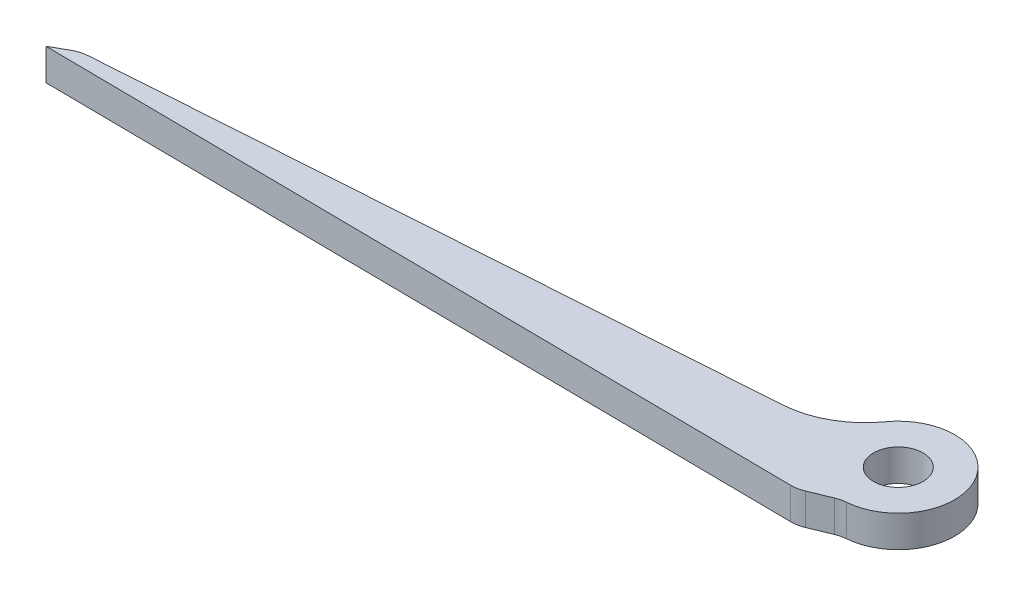
ISO-10303-21;
HEADER;
FILE_DESCRIPTION(('STEP AP214'),'2;1');
FILE_NAME('part.step','',(''),(''),'','','');
FILE_SCHEMA(('AUTOMOTIVE_DESIGN { 1 0 10303 214 1 1 1 1 }'));
ENDSEC;
DATA;
#1=APPLICATION_CONTEXT('core data for automotive mechanical design processes');
#2=APPLICATION_PROTOCOL_DEFINITION('international standard','automotive_design',2000,#1);
#3=PRODUCT_CONTEXT('',#1,'mechanical');
#4=PRODUCT('Part','Part','',(#3));
#5=PRODUCT_RELATED_PRODUCT_CATEGORY('part','',(#4));
#6=PRODUCT_DEFINITION_FORMATION('','',#4);
#7=PRODUCT_DEFINITION_CONTEXT('part definition',#1,'design');
#8=PRODUCT_DEFINITION('design','',#6,#7);
#9=PRODUCT_DEFINITION_SHAPE('','',#8);
#10=(LENGTH_UNIT() NAMED_UNIT(*) SI_UNIT(.MILLI.,.METRE.));
#11=(NAMED_UNIT(*) PLANE_ANGLE_UNIT() SI_UNIT($,.RADIAN.));
#12=(NAMED_UNIT(*) SI_UNIT($,.STERADIAN.) SOLID_ANGLE_UNIT());
#13=UNCERTAINTY_MEASURE_WITH_UNIT(LENGTH_MEASURE(1.E-05),#10,'distance_accuracy_value','');
#14=(GEOMETRIC_REPRESENTATION_CONTEXT(3) GLOBAL_UNCERTAINTY_ASSIGNED_CONTEXT((#13)) GLOBAL_UNIT_ASSIGNED_CONTEXT((#10,
#11,#12)) REPRESENTATION_CONTEXT('',''));
#15=CARTESIAN_POINT('',(0.,0.,0.));
#16=DIRECTION('',(0.,0.,1.));
#17=DIRECTION('',(1.,0.,0.));
#18=AXIS2_PLACEMENT_3D('',#15,#16,#17);
#19=CARTESIAN_POINT('',(0.,3.175,0.));
#20=DIRECTION('',(0.,1.,0.));
#21=DIRECTION('',(0.,0.,1.));
#22=AXIS2_PLACEMENT_3D('',#19,#20,#21);
#23=PLANE('',#22);
#24=CARTESIAN_POINT('',(0.,3.175,0.));
#25=DIRECTION('',(0.,1.,0.));
#26=DIRECTION('',(0.,0.,1.));
#27=AXIS2_PLACEMENT_3D('',#24,#25,#26);
#28=CIRCLE('',#27,5.6642);
#29=CARTESIAN_POINT('',(0.444946616900004,3.175,5.64669674660409));
#30=VERTEX_POINT('',#29);
#31=CARTESIAN_POINT('',(-4.60174845221113,3.175,-3.30258577823082));
#32=VERTEX_POINT('',#31);
#33=EDGE_CURVE('E147',#30,#32,#28,.T.);
#34=ORIENTED_EDGE('',*,*,#33,.T.);
#35=CARTESIAN_POINT('',(-11.8242236014214,3.175,-8.48601637186662));
#36=DIRECTION('',(0.,1.,0.));
#37=DIRECTION('',(0.,0.,1.));
#38=AXIS2_PLACEMENT_3D('',#35,#36,#37);
#39=CIRCLE('',#38,8.89);
#40=CARTESIAN_POINT('',(-11.2121421211736,3.175,0.382887521035677));
#41=VERTEX_POINT('',#40);
#42=EDGE_CURVE('E11',#32,#41,#39,.F.);
#43=ORIENTED_EDGE('',*,*,#42,.T.);
#44=DIRECTION('',(-0.997626984578437,0.,0.0688505602078505));
#45=VECTOR('',#44,1.);
#46=CARTESIAN_POINT('',(-5.6642,3.175,0.));
#47=LINE('',#46,#45);
#48=CARTESIAN_POINT('',(-76.4638174473622,3.175,4.8861883239979));
#49=VERTEX_POINT('',#48);
#50=EDGE_CURVE('E116',#41,#49,#47,.T.);
#51=ORIENTED_EDGE('',*,*,#50,.T.);
#52=CARTESIAN_POINT('',(-76.2452169187023,3.175,8.05365400003444));
#53=DIRECTION('',(0.,1.,0.));
#54=DIRECTION('',(0.,0.,1.));
#55=AXIS2_PLACEMENT_3D('',#52,#53,#54);
#56=CIRCLE('',#55,3.175);
#57=CARTESIAN_POINT('',(-77.8039136184842,3.175,5.28759369734959));
#58=VERTEX_POINT('',#57);
#59=EDGE_CURVE('E112',#49,#58,#56,.T.);
#60=ORIENTED_EDGE('',*,*,#59,.T.);
#61=DIRECTION('',(-0.871200095333811,0.,0.490928094419497));
#62=VECTOR('',#61,1.);
#63=CARTESIAN_POINT('',(-77.1791945502583,3.175,4.93555959708459));
#64=LINE('',#63,#62);
#65=CARTESIAN_POINT('',(-79.3920427924062,3.175,6.18251695691011));
#66=VERTEX_POINT('',#65);
#67=EDGE_CURVE('E105',#58,#66,#64,.T.);
#68=ORIENTED_EDGE('',*,*,#67,.T.);
#69=DIRECTION('',(0.999945461548254,0.,0.0104438464681303));
#70=VECTOR('',#69,1.);
#71=CARTESIAN_POINT('',(-79.3920427924062,3.175,6.18251695691011));
#72=LINE('',#71,#70);
#73=CARTESIAN_POINT('',(-3.83726556900571,3.175,6.97164248784978));
#74=VERTEX_POINT('',#73);
#75=EDGE_CURVE('E109',#66,#74,#72,.T.);
#76=ORIENTED_EDGE('',*,*,#75,.T.);
#77=CARTESIAN_POINT('',(-3.80410635646939,3.175,3.79681564743408));
#78=DIRECTION('',(0.,1.,0.));
#79=DIRECTION('',(0.,0.,1.));
#80=AXIS2_PLACEMENT_3D('',#77,#78,#79);
#81=CIRCLE('',#80,3.175);
#82=CARTESIAN_POINT('',(-2.59537443766945,3.175,6.73272984040263));
#83=VERTEX_POINT('',#82);
#84=EDGE_CURVE('E158',#74,#83,#81,.T.);
#85=ORIENTED_EDGE('',*,*,#84,.T.);
#86=DIRECTION('',(0.924697383612144,0.,-0.380702966551163));
#87=VECTOR('',#86,1.);
#88=CARTESIAN_POINT('',(-3.19204279240622,3.175,6.9783814629996));
#89=LINE('',#88,#87);
#90=CARTESIAN_POINT('',(-0.514375763278859,3.175,5.87597131294276));
#91=VERTEX_POINT('',#90);
#92=EDGE_CURVE('E127',#83,#91,#89,.T.);
#93=ORIENTED_EDGE('',*,*,#92,.T.);
#94=CARTESIAN_POINT('',(0.694356155521082,3.175,8.81188550591132));
#95=DIRECTION('',(0.,1.,0.));
#96=DIRECTION('',(0.,0.,1.));
#97=AXIS2_PLACEMENT_3D('',#94,#95,#96);
#98=CIRCLE('',#97,3.175);
#99=EDGE_CURVE('E172',#91,#30,#98,.F.);
#100=ORIENTED_EDGE('',*,*,#99,.T.);
#101=EDGE_LOOP('',(#34,#43,#51,#60,#68,#76,#85,#93,#100));
#102=FACE_BOUND('',#101,.T.);
#103=CARTESIAN_POINT('',(0.,3.175,0.));
#104=DIRECTION('',(0.,1.,0.));
#105=DIRECTION('',(0.,0.,1.));
#106=AXIS2_PLACEMENT_3D('',#103,#104,#105);
#107=CIRCLE('',#106,2.4892);
#108=CARTESIAN_POINT('',(0.,3.175,2.4892));
#109=VERTEX_POINT('',#108);
#110=EDGE_CURVE('E140',#109,#109,#107,.T.);
#111=ORIENTED_EDGE('',*,*,#110,.F.);
#112=EDGE_LOOP('',(#111));
#113=FACE_BOUND('',#112,.T.);
#114=ADVANCED_FACE('F34',(#102,#113),#23,.T.);
#115=CARTESIAN_POINT('',(0.,0.,0.));
#116=DIRECTION('',(0.,1.,0.));
#117=DIRECTION('',(0.,0.,1.));
#118=AXIS2_PLACEMENT_3D('',#115,#116,#117);
#119=PLANE('',#118);
#120=DIRECTION('',(-0.871200095333811,0.,0.490928094419497));
#121=VECTOR('',#120,1.);
#122=CARTESIAN_POINT('',(-77.1791945502583,0.,4.93555959708459));
#123=LINE('',#122,#121);
#124=CARTESIAN_POINT('',(-77.8039136184842,0.,5.28759369734959));
#125=VERTEX_POINT('',#124);
#126=CARTESIAN_POINT('',(-79.3920427924062,0.,6.18251695691011));
#127=VERTEX_POINT('',#126);
#128=EDGE_CURVE('E122',#125,#127,#123,.T.);
#129=ORIENTED_EDGE('',*,*,#128,.F.);
#130=CARTESIAN_POINT('',(-76.2452169187023,0.,8.05365400003444));
#131=DIRECTION('',(0.,1.,0.));
#132=DIRECTION('',(0.,0.,1.));
#133=AXIS2_PLACEMENT_3D('',#130,#131,#132);
#134=CIRCLE('',#133,3.175);
#135=CARTESIAN_POINT('',(-76.4638174473622,0.,4.8861883239979));
#136=VERTEX_POINT('',#135);
#137=EDGE_CURVE('E152',#125,#136,#134,.F.);
#138=ORIENTED_EDGE('',*,*,#137,.T.);
#139=DIRECTION('',(-0.997626984578437,0.,0.0688505602078505));
#140=VECTOR('',#139,1.);
#141=CARTESIAN_POINT('',(-5.6642,0.,0.));
#142=LINE('',#141,#140);
#143=CARTESIAN_POINT('',(-11.2121421211736,0.,0.382887521035677));
#144=VERTEX_POINT('',#143);
#145=EDGE_CURVE('E139',#144,#136,#142,.T.);
#146=ORIENTED_EDGE('',*,*,#145,.F.);
#147=CARTESIAN_POINT('',(-11.8242236014214,0.,-8.48601637186662));
#148=DIRECTION('',(0.,1.,0.));
#149=DIRECTION('',(0.,0.,1.));
#150=AXIS2_PLACEMENT_3D('',#147,#148,#149);
#151=CIRCLE('',#150,8.89);
#152=CARTESIAN_POINT('',(-4.60174845221113,0.,-3.30258577823082));
#153=VERTEX_POINT('',#152);
#154=EDGE_CURVE('E42',#144,#153,#151,.T.);
#155=ORIENTED_EDGE('',*,*,#154,.T.);
#156=CARTESIAN_POINT('',(0.,0.,0.));
#157=DIRECTION('',(0.,1.,0.));
#158=DIRECTION('',(0.,0.,1.));
#159=AXIS2_PLACEMENT_3D('',#156,#157,#158);
#160=CIRCLE('',#159,5.6642);
#161=CARTESIAN_POINT('',(0.444946616900004,0.,5.64669674660409));
#162=VERTEX_POINT('',#161);
#163=EDGE_CURVE('E137',#162,#153,#160,.T.);
#164=ORIENTED_EDGE('',*,*,#163,.F.);
#165=CARTESIAN_POINT('',(0.694356155521082,0.,8.81188550591132));
#166=DIRECTION('',(0.,1.,0.));
#167=DIRECTION('',(0.,0.,1.));
#168=AXIS2_PLACEMENT_3D('',#165,#166,#167);
#169=CIRCLE('',#168,3.175);
#170=CARTESIAN_POINT('',(-0.514375763278859,0.,5.87597131294276));
#171=VERTEX_POINT('',#170);
#172=EDGE_CURVE('E170',#162,#171,#169,.T.);
#173=ORIENTED_EDGE('',*,*,#172,.T.);
#174=DIRECTION('',(0.924697383612144,0.,-0.380702966551163));
#175=VECTOR('',#174,1.);
#176=CARTESIAN_POINT('',(-3.19204279240622,0.,6.9783814629996));
#177=LINE('',#176,#175);
#178=CARTESIAN_POINT('',(-2.59537443766945,0.,6.73272984040263));
#179=VERTEX_POINT('',#178);
#180=EDGE_CURVE('E145',#179,#171,#177,.T.);
#181=ORIENTED_EDGE('',*,*,#180,.F.);
#182=CARTESIAN_POINT('',(-3.80410635646939,0.,3.79681564743408));
#183=DIRECTION('',(0.,1.,0.));
#184=DIRECTION('',(0.,0.,1.));
#185=AXIS2_PLACEMENT_3D('',#182,#183,#184);
#186=CIRCLE('',#185,3.175);
#187=CARTESIAN_POINT('',(-3.83726556900571,0.,6.97164248784978));
#188=VERTEX_POINT('',#187);
#189=EDGE_CURVE('E150',#179,#188,#186,.F.);
#190=ORIENTED_EDGE('',*,*,#189,.T.);
#191=DIRECTION('',(0.999945461548254,0.,0.0104438464681303));
#192=VECTOR('',#191,1.);
#193=CARTESIAN_POINT('',(-79.3920427924062,0.,6.18251695691011));
#194=LINE('',#193,#192);
#195=EDGE_CURVE('E143',#127,#188,#194,.T.);
#196=ORIENTED_EDGE('',*,*,#195,.F.);
#197=EDGE_LOOP('',(#129,#138,#146,#155,#164,#173,#181,#190,#196));
#198=FACE_BOUND('',#197,.T.);
#199=CARTESIAN_POINT('',(0.,0.,0.));
#200=DIRECTION('',(0.,1.,0.));
#201=DIRECTION('',(0.,0.,1.));
#202=AXIS2_PLACEMENT_3D('',#199,#200,#201);
#203=CIRCLE('',#202,2.4892);
#204=CARTESIAN_POINT('',(0.,0.,2.4892));
#205=VERTEX_POINT('',#204);
#206=EDGE_CURVE('E226',#205,#205,#203,.T.);
#207=ORIENTED_EDGE('',*,*,#206,.T.);
#208=EDGE_LOOP('',(#207));
#209=FACE_BOUND('',#208,.T.);
#210=ADVANCED_FACE('F183',(#198,#209),#119,.F.);
#211=CARTESIAN_POINT('',(0.,3.175,0.));
#212=DIRECTION('',(0.,-1.,0.));
#213=DIRECTION('',(0.,0.,-1.));
#214=AXIS2_PLACEMENT_3D('',#211,#212,#213);
#215=CYLINDRICAL_SURFACE('',#214,5.6642);
#216=ORIENTED_EDGE('',*,*,#163,.T.);
#217=DIRECTION('',(0.,-1.,0.));
#218=VECTOR('',#217,1.);
#219=CARTESIAN_POINT('',(-4.60174845221113,3.175,-3.30258577823082));
#220=LINE('',#219,#218);
#221=EDGE_CURVE('E55',#153,#32,#220,.F.);
#222=ORIENTED_EDGE('',*,*,#221,.T.);
#223=ORIENTED_EDGE('',*,*,#33,.F.);
#224=DIRECTION('',(0.,-1.,0.));
#225=VECTOR('',#224,1.);
#226=CARTESIAN_POINT('',(0.444946616900004,3.175,5.64669674660409));
#227=LINE('',#226,#225);
#228=EDGE_CURVE('E167',#30,#162,#227,.T.);
#229=ORIENTED_EDGE('',*,*,#228,.T.);
#230=EDGE_LOOP('',(#216,#222,#223,#229));
#231=FACE_BOUND('',#230,.T.);
#232=ADVANCED_FACE('F208',(#231),#215,.T.);
#233=CARTESIAN_POINT('',(-5.6642,3.175,0.));
#234=DIRECTION('',(0.0688505602078505,0.,0.997626984578437));
#235=DIRECTION('',(0.997626984578437,0.,-0.0688505602078505));
#236=AXIS2_PLACEMENT_3D('',#233,#234,#235);
#237=PLANE('',#236);
#238=ORIENTED_EDGE('',*,*,#50,.F.);
#239=DIRECTION('',(0.,1.,0.));
#240=VECTOR('',#239,1.);
#241=CARTESIAN_POINT('',(-11.2121421211736,0.,0.382887521035675));
#242=LINE('',#241,#240);
#243=EDGE_CURVE('E174',#41,#144,#242,.F.);
#244=ORIENTED_EDGE('',*,*,#243,.T.);
#245=ORIENTED_EDGE('',*,*,#145,.T.);
#246=DIRECTION('',(0.,-1.,0.));
#247=VECTOR('',#246,1.);
#248=CARTESIAN_POINT('',(-76.4638174473622,3.175,4.8861883239979));
#249=LINE('',#248,#247);
#250=EDGE_CURVE('E155',#136,#49,#249,.F.);
#251=ORIENTED_EDGE('',*,*,#250,.T.);
#252=EDGE_LOOP('',(#238,#244,#245,#251));
#253=FACE_BOUND('',#252,.T.);
#254=ADVANCED_FACE('F180',(#253),#237,.F.);
#255=CARTESIAN_POINT('',(-77.1791945502583,3.175,4.93555959708459));
#256=DIRECTION('',(0.490928094419497,0.,0.871200095333811));
#257=DIRECTION('',(0.871200095333811,0.,-0.490928094419497));
#258=AXIS2_PLACEMENT_3D('',#255,#256,#257);
#259=PLANE('',#258);
#260=ORIENTED_EDGE('',*,*,#67,.F.);
#261=DIRECTION('',(0.,-1.,0.));
#262=VECTOR('',#261,1.);
#263=CARTESIAN_POINT('',(-77.8039136184842,3.175,5.28759369734959));
#264=LINE('',#263,#262);
#265=EDGE_CURVE('E126',#58,#125,#264,.T.);
#266=ORIENTED_EDGE('',*,*,#265,.T.);
#267=ORIENTED_EDGE('',*,*,#128,.T.);
#268=DIRECTION('',(0.,-1.,0.));
#269=VECTOR('',#268,1.);
#270=CARTESIAN_POINT('',(-79.3920427924062,3.175,6.18251695691011));
#271=LINE('',#270,#269);
#272=EDGE_CURVE('E119',#66,#127,#271,.T.);
#273=ORIENTED_EDGE('',*,*,#272,.F.);
#274=EDGE_LOOP('',(#260,#266,#267,#273));
#275=FACE_BOUND('',#274,.T.);
#276=ADVANCED_FACE('F120',(#275),#259,.F.);
#277=CARTESIAN_POINT('',(-79.3920427924062,3.175,6.18251695691011));
#278=DIRECTION('',(0.0104438464681303,0.,-0.999945461548254));
#279=DIRECTION('',(-0.999945461548254,0.,-0.0104438464681303));
#280=AXIS2_PLACEMENT_3D('',#277,#278,#279);
#281=PLANE('',#280);
#282=ORIENTED_EDGE('',*,*,#195,.T.);
#283=DIRECTION('',(0.,-1.,0.));
#284=VECTOR('',#283,1.);
#285=CARTESIAN_POINT('',(-3.83726556900571,3.175,6.97164248784978));
#286=LINE('',#285,#284);
#287=EDGE_CURVE('E131',#188,#74,#286,.F.);
#288=ORIENTED_EDGE('',*,*,#287,.T.);
#289=ORIENTED_EDGE('',*,*,#75,.F.);
#290=ORIENTED_EDGE('',*,*,#272,.T.);
#291=EDGE_LOOP('',(#282,#288,#289,#290));
#292=FACE_BOUND('',#291,.T.);
#293=ADVANCED_FACE('F129',(#292),#281,.F.);
#294=CARTESIAN_POINT('',(-3.19204279240622,3.175,6.9783814629996));
#295=DIRECTION('',(-0.380702966551163,0.,-0.924697383612144));
#296=DIRECTION('',(-0.924697383612144,0.,0.380702966551163));
#297=AXIS2_PLACEMENT_3D('',#294,#295,#296);
#298=PLANE('',#297);
#299=ORIENTED_EDGE('',*,*,#92,.F.);
#300=DIRECTION('',(0.,-1.,0.));
#301=VECTOR('',#300,1.);
#302=CARTESIAN_POINT('',(-2.59537443766945,3.175,6.73272984040263));
#303=LINE('',#302,#301);
#304=EDGE_CURVE('E163',#83,#179,#303,.T.);
#305=ORIENTED_EDGE('',*,*,#304,.T.);
#306=ORIENTED_EDGE('',*,*,#180,.T.);
#307=DIRECTION('',(0.,1.,0.));
#308=VECTOR('',#307,1.);
#309=CARTESIAN_POINT('',(-0.514375763278859,3.175,5.87597131294276));
#310=LINE('',#309,#308);
#311=EDGE_CURVE('E161',#171,#91,#310,.T.);
#312=ORIENTED_EDGE('',*,*,#311,.T.);
#313=EDGE_LOOP('',(#299,#305,#306,#312));
#314=FACE_BOUND('',#313,.T.);
#315=ADVANCED_FACE('F199',(#314),#298,.F.);
#316=CARTESIAN_POINT('',(0.,3.175,0.));
#317=DIRECTION('',(0.,-1.,0.));
#318=DIRECTION('',(0.,0.,-1.));
#319=AXIS2_PLACEMENT_3D('',#316,#317,#318);
#320=CYLINDRICAL_SURFACE('',#319,2.4892);
#321=ORIENTED_EDGE('',*,*,#110,.T.);
#322=EDGE_LOOP('',(#321));
#323=FACE_BOUND('',#322,.T.);
#324=ORIENTED_EDGE('',*,*,#206,.F.);
#325=EDGE_LOOP('',(#324));
#326=FACE_BOUND('',#325,.T.);
#327=ADVANCED_FACE('F190',(#323,#326),#320,.F.);
#328=CARTESIAN_POINT('',(-76.2452169187023,3.175,8.05365400003444));
#329=DIRECTION('',(0.,-1.,0.));
#330=DIRECTION('',(0.,0.,-1.));
#331=AXIS2_PLACEMENT_3D('',#328,#329,#330);
#332=CYLINDRICAL_SURFACE('',#331,3.175);
#333=ORIENTED_EDGE('',*,*,#59,.F.);
#334=ORIENTED_EDGE('',*,*,#250,.F.);
#335=ORIENTED_EDGE('',*,*,#137,.F.);
#336=ORIENTED_EDGE('',*,*,#265,.F.);
#337=EDGE_LOOP('',(#333,#334,#335,#336));
#338=FACE_BOUND('',#337,.T.);
#339=ADVANCED_FACE('F187',(#338),#332,.T.);
#340=CARTESIAN_POINT('',(-3.80410635646939,3.175,3.79681564743408));
#341=DIRECTION('',(0.,-1.,0.));
#342=DIRECTION('',(0.,0.,-1.));
#343=AXIS2_PLACEMENT_3D('',#340,#341,#342);
#344=CYLINDRICAL_SURFACE('',#343,3.175);
#345=ORIENTED_EDGE('',*,*,#84,.F.);
#346=ORIENTED_EDGE('',*,*,#287,.F.);
#347=ORIENTED_EDGE('',*,*,#189,.F.);
#348=ORIENTED_EDGE('',*,*,#304,.F.);
#349=EDGE_LOOP('',(#345,#346,#347,#348));
#350=FACE_BOUND('',#349,.T.);
#351=ADVANCED_FACE('F189',(#350),#344,.T.);
#352=CARTESIAN_POINT('',(0.694356155521082,3.175,8.81188550591132));
#353=DIRECTION('',(0.,-1.,0.));
#354=DIRECTION('',(0.,0.,-1.));
#355=AXIS2_PLACEMENT_3D('',#352,#353,#354);
#356=CYLINDRICAL_SURFACE('',#355,3.175);
#357=ORIENTED_EDGE('',*,*,#99,.F.);
#358=ORIENTED_EDGE('',*,*,#311,.F.);
#359=ORIENTED_EDGE('',*,*,#172,.F.);
#360=ORIENTED_EDGE('',*,*,#228,.F.);
#361=EDGE_LOOP('',(#357,#358,#359,#360));
#362=FACE_BOUND('',#361,.T.);
#363=ADVANCED_FACE('F196',(#362),#356,.F.);
#364=CARTESIAN_POINT('',(-11.8242236014214,3.175,-8.48601637186662));
#365=DIRECTION('',(0.,-1.,0.));
#366=DIRECTION('',(0.,0.,-1.));
#367=AXIS2_PLACEMENT_3D('',#364,#365,#366);
#368=CYLINDRICAL_SURFACE('',#367,8.89);
#369=ORIENTED_EDGE('',*,*,#42,.F.);
#370=ORIENTED_EDGE('',*,*,#221,.F.);
#371=ORIENTED_EDGE('',*,*,#154,.F.);
#372=ORIENTED_EDGE('',*,*,#243,.F.);
#373=EDGE_LOOP('',(#369,#370,#371,#372));
#374=FACE_BOUND('',#373,.T.);
#375=ADVANCED_FACE('F36',(#374),#368,.F.);
#376=CLOSED_SHELL('',(#114,#210,#232,#254,#276,#293,#315,#327,#339,#351,#363,#375));
#377=MANIFOLD_SOLID_BREP('B2',#376);
#378=ADVANCED_BREP_SHAPE_REPRESENTATION('',(#18,#377),#14);
#379=SHAPE_DEFINITION_REPRESENTATION(#9,#378);
ENDSEC;
END-ISO-10303-21;
